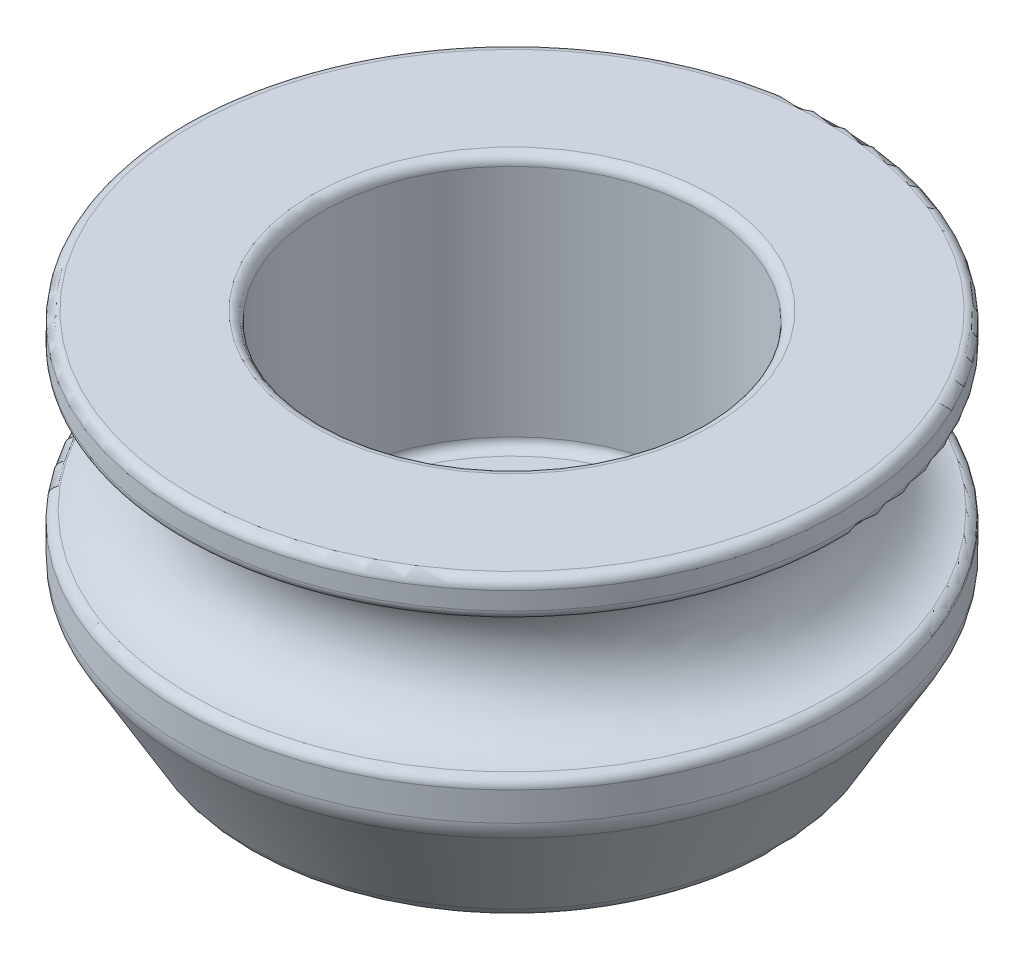
ISO-10303-21;
HEADER;
FILE_DESCRIPTION(('STEP AP214'),'2;1');
FILE_NAME('part.step','',(''),(''),'','','');
FILE_SCHEMA(('AUTOMOTIVE_DESIGN { 1 0 10303 214 1 1 1 1 }'));
ENDSEC;
DATA;
#1=APPLICATION_CONTEXT('core data for automotive mechanical design processes');
#2=APPLICATION_PROTOCOL_DEFINITION('international standard','automotive_design',2000,#1);
#3=PRODUCT_CONTEXT('',#1,'mechanical');
#4=PRODUCT('Part','Part','',(#3));
#5=PRODUCT_RELATED_PRODUCT_CATEGORY('part','',(#4));
#6=PRODUCT_DEFINITION_FORMATION('','',#4);
#7=PRODUCT_DEFINITION_CONTEXT('part definition',#1,'design');
#8=PRODUCT_DEFINITION('design','',#6,#7);
#9=PRODUCT_DEFINITION_SHAPE('','',#8);
#10=(LENGTH_UNIT() NAMED_UNIT(*) SI_UNIT(.MILLI.,.METRE.));
#11=(NAMED_UNIT(*) PLANE_ANGLE_UNIT() SI_UNIT($,.RADIAN.));
#12=(NAMED_UNIT(*) SI_UNIT($,.STERADIAN.) SOLID_ANGLE_UNIT());
#13=UNCERTAINTY_MEASURE_WITH_UNIT(LENGTH_MEASURE(1.E-05),#10,'distance_accuracy_value','');
#14=(GEOMETRIC_REPRESENTATION_CONTEXT(3) GLOBAL_UNCERTAINTY_ASSIGNED_CONTEXT((#13)) GLOBAL_UNIT_ASSIGNED_CONTEXT((#10,
#11,#12)) REPRESENTATION_CONTEXT('',''));
#15=CARTESIAN_POINT('',(0.,0.,0.));
#16=DIRECTION('',(0.,0.,1.));
#17=DIRECTION('',(1.,0.,0.));
#18=AXIS2_PLACEMENT_3D('',#15,#16,#17);
#19=CARTESIAN_POINT('',(0.,9.017,0.));
#20=DIRECTION('',(0.,-1.,0.));
#21=DIRECTION('',(0.,0.,-1.));
#22=AXIS2_PLACEMENT_3D('',#19,#20,#21);
#23=CYLINDRICAL_SURFACE('',#22,8.5725);
#24=CARTESIAN_POINT('',(0.,8.30255699408002,0.));
#25=DIRECTION('',(0.,1.,0.));
#26=DIRECTION('',(0.,0.,1.));
#27=AXIS2_PLACEMENT_3D('',#24,#25,#26);
#28=CIRCLE('',#27,8.5725);
#29=CARTESIAN_POINT('',(0.172203570587984,8.30255699408002,-8.57077022094728));
#30=VERTEX_POINT('',#29);
#31=EDGE_CURVE('E71',#30,#30,#28,.T.);
#32=ORIENTED_EDGE('',*,*,#31,.T.);
#33=EDGE_LOOP('',(#32));
#34=FACE_BOUND('',#33,.T.);
#35=CARTESIAN_POINT('',(0.,8.763,0.));
#36=DIRECTION('',(0.,1.,0.));
#37=DIRECTION('',(0.,0.,1.));
#38=AXIS2_PLACEMENT_3D('',#35,#36,#37);
#39=CIRCLE('',#38,8.5725);
#40=CARTESIAN_POINT('',(0.,8.763,8.5725));
#41=VERTEX_POINT('',#40);
#42=EDGE_CURVE('E110',#41,#41,#39,.F.);
#43=ORIENTED_EDGE('',*,*,#42,.T.);
#44=EDGE_LOOP('',(#43));
#45=FACE_BOUND('',#44,.T.);
#46=ADVANCED_FACE('F41',(#34,#45),#23,.T.);
#47=CARTESIAN_POINT('',(0.,3.52074884677059,0.));
#48=DIRECTION('',(0.,-1.,0.));
#49=DIRECTION('',(0.,0.,-1.));
#50=AXIS2_PLACEMENT_3D('',#47,#48,#49);
#51=CIRCLE('',#50,8.5725);
#52=CARTESIAN_POINT('',(0.,3.52074884677059,-8.5725));
#53=VERTEX_POINT('',#52);
#54=EDGE_CURVE('E82',#53,#53,#51,.F.);
#55=ORIENTED_EDGE('',*,*,#54,.T.);
#56=EDGE_LOOP('',(#55));
#57=FACE_BOUND('',#56,.T.);
#58=CARTESIAN_POINT('',(0.,4.27044300591999,0.));
#59=DIRECTION('',(0.,-1.,0.));
#60=DIRECTION('',(0.,0.,-1.));
#61=AXIS2_PLACEMENT_3D('',#58,#59,#60);
#62=CIRCLE('',#61,8.5725);
#63=CARTESIAN_POINT('',(0.172203570587985,4.27044300591999,-8.57077022094728));
#64=VERTEX_POINT('',#63);
#65=EDGE_CURVE('E104',#64,#64,#62,.T.);
#66=ORIENTED_EDGE('',*,*,#65,.T.);
#67=EDGE_LOOP('',(#66));
#68=FACE_BOUND('',#67,.T.);
#69=ADVANCED_FACE('F98',(#57,#68),#23,.T.);
#70=CARTESIAN_POINT('',(0.,-9.69867661075468,0.));
#71=DIRECTION('',(0.,1.,0.));
#72=DIRECTION('',(0.,0.,1.));
#73=AXIS2_PLACEMENT_3D('',#70,#71,#72);
#74=CYLINDRICAL_SURFACE('',#73,3.429);
#75=CARTESIAN_POINT('',(0.,2.159,0.));
#76=DIRECTION('',(0.,1.,0.));
#77=DIRECTION('',(0.,0.,1.));
#78=AXIS2_PLACEMENT_3D('',#75,#76,#77);
#79=CIRCLE('',#78,3.429);
#80=CARTESIAN_POINT('',(0.,2.159,3.429));
#81=VERTEX_POINT('',#80);
#82=EDGE_CURVE('E125',#81,#81,#79,.T.);
#83=ORIENTED_EDGE('',*,*,#82,.T.);
#84=EDGE_LOOP('',(#83));
#85=FACE_BOUND('',#84,.T.);
#86=CARTESIAN_POINT('',(0.,0.254000000000001,0.));
#87=DIRECTION('',(0.,1.,0.));
#88=DIRECTION('',(0.,0.,1.));
#89=AXIS2_PLACEMENT_3D('',#86,#87,#88);
#90=CIRCLE('',#89,3.429);
#91=CARTESIAN_POINT('',(0.,0.254000000000001,3.429));
#92=VERTEX_POINT('',#91);
#93=EDGE_CURVE('E122',#92,#92,#90,.F.);
#94=ORIENTED_EDGE('',*,*,#93,.T.);
#95=EDGE_LOOP('',(#94));
#96=FACE_BOUND('',#95,.T.);
#97=ADVANCED_FACE('F101',(#85,#96),#74,.F.);
#98=CARTESIAN_POINT('',(0.,9.017,0.));
#99=DIRECTION('',(0.,1.,0.));
#100=DIRECTION('',(0.,0.,1.));
#101=AXIS2_PLACEMENT_3D('',#98,#99,#100);
#102=PLANE('',#101);
#103=CARTESIAN_POINT('',(0.,9.017,0.));
#104=DIRECTION('',(0.,1.,0.));
#105=DIRECTION('',(0.,0.,1.));
#106=AXIS2_PLACEMENT_3D('',#103,#104,#105);
#107=CIRCLE('',#106,5.207);
#108=CARTESIAN_POINT('',(0.,9.017,5.207));
#109=VERTEX_POINT('',#108);
#110=EDGE_CURVE('E79',#109,#109,#107,.F.);
#111=ORIENTED_EDGE('',*,*,#110,.T.);
#112=EDGE_LOOP('',(#111));
#113=FACE_BOUND('',#112,.T.);
#114=CARTESIAN_POINT('',(0.,9.017,0.));
#115=DIRECTION('',(0.,1.,0.));
#116=DIRECTION('',(0.,0.,1.));
#117=AXIS2_PLACEMENT_3D('',#114,#115,#116);
#118=CIRCLE('',#117,8.3185);
#119=CARTESIAN_POINT('',(0.,9.017,8.3185));
#120=VERTEX_POINT('',#119);
#121=EDGE_CURVE('E130',#120,#120,#118,.T.);
#122=ORIENTED_EDGE('',*,*,#121,.T.);
#123=EDGE_LOOP('',(#122));
#124=FACE_BOUND('',#123,.T.);
#125=ADVANCED_FACE('F137',(#113,#124),#102,.T.);
#126=CARTESIAN_POINT('',(0.,0.,0.));
#127=DIRECTION('',(0.,1.,0.));
#128=DIRECTION('',(0.,0.,1.));
#129=AXIS2_PLACEMENT_3D('',#126,#127,#128);
#130=PLANE('',#129);
#131=CARTESIAN_POINT('',(0.,0.,0.));
#132=DIRECTION('',(0.,1.,0.));
#133=DIRECTION('',(0.,0.,1.));
#134=AXIS2_PLACEMENT_3D('',#131,#132,#133);
#135=CIRCLE('',#134,6.19089735278396);
#136=CARTESIAN_POINT('',(0.,0.,6.19089735278396));
#137=VERTEX_POINT('',#136);
#138=EDGE_CURVE('E11',#137,#137,#135,.F.);
#139=ORIENTED_EDGE('',*,*,#138,.T.);
#140=EDGE_LOOP('',(#139));
#141=FACE_BOUND('',#140,.T.);
#142=CARTESIAN_POINT('',(0.,0.,0.));
#143=DIRECTION('',(0.,1.,0.));
#144=DIRECTION('',(0.,0.,1.));
#145=AXIS2_PLACEMENT_3D('',#142,#143,#144);
#146=CIRCLE('',#145,3.683);
#147=CARTESIAN_POINT('',(0.,0.,3.683));
#148=VERTEX_POINT('',#147);
#149=EDGE_CURVE('E128',#148,#148,#146,.T.);
#150=ORIENTED_EDGE('',*,*,#149,.T.);
#151=EDGE_LOOP('',(#150));
#152=FACE_BOUND('',#151,.T.);
#153=ADVANCED_FACE('F159',(#141,#152),#130,.F.);
#154=CARTESIAN_POINT('',(0.,2.413,0.));
#155=DIRECTION('',(0.,1.,0.));
#156=DIRECTION('',(0.,0.,1.));
#157=AXIS2_PLACEMENT_3D('',#154,#155,#156);
#158=PLANE('',#157);
#159=CARTESIAN_POINT('',(0.,2.413,0.));
#160=DIRECTION('',(0.,1.,0.));
#161=DIRECTION('',(0.,0.,1.));
#162=AXIS2_PLACEMENT_3D('',#159,#160,#161);
#163=CIRCLE('',#162,4.699);
#164=CARTESIAN_POINT('',(0.,2.413,4.699));
#165=VERTEX_POINT('',#164);
#166=EDGE_CURVE('E108',#165,#165,#163,.T.);
#167=ORIENTED_EDGE('',*,*,#166,.T.);
#168=EDGE_LOOP('',(#167));
#169=FACE_BOUND('',#168,.T.);
#170=CARTESIAN_POINT('',(0.,2.413,0.));
#171=DIRECTION('',(0.,1.,0.));
#172=DIRECTION('',(0.,0.,1.));
#173=AXIS2_PLACEMENT_3D('',#170,#171,#172);
#174=CIRCLE('',#173,3.683);
#175=CARTESIAN_POINT('',(0.,2.413,3.683));
#176=VERTEX_POINT('',#175);
#177=EDGE_CURVE('E105',#176,#176,#174,.F.);
#178=ORIENTED_EDGE('',*,*,#177,.T.);
#179=EDGE_LOOP('',(#178));
#180=FACE_BOUND('',#179,.T.);
#181=ADVANCED_FACE('F150',(#169,#180),#158,.T.);
#182=CARTESIAN_POINT('',(0.,2.413,0.));
#183=DIRECTION('',(0.,1.,0.));
#184=DIRECTION('',(0.,0.,1.));
#185=AXIS2_PLACEMENT_3D('',#182,#183,#184);
#186=CYLINDRICAL_SURFACE('',#185,4.953);
#187=CARTESIAN_POINT('',(0.,2.667,0.));
#188=DIRECTION('',(0.,1.,0.));
#189=DIRECTION('',(0.,0.,1.));
#190=AXIS2_PLACEMENT_3D('',#187,#188,#189);
#191=CIRCLE('',#190,4.953);
#192=CARTESIAN_POINT('',(0.,2.667,4.953));
#193=VERTEX_POINT('',#192);
#194=EDGE_CURVE('E119',#193,#193,#191,.F.);
#195=CARTESIAN_POINT('',(0.,8.763,0.));
#196=DIRECTION('',(0.,1.,0.));
#197=DIRECTION('',(0.,0.,1.));
#198=AXIS2_PLACEMENT_3D('',#195,#196,#197);
#199=CIRCLE('',#198,4.953);
#200=CARTESIAN_POINT('',(0.,8.763,4.953));
#201=VERTEX_POINT('',#200);
#202=EDGE_CURVE('E116',#201,#201,#199,.T.);
#203=CARTESIAN_POINT('',(0.,2.667,4.953));
#204=CARTESIAN_POINT('',(0.,2.7305,4.953));
#205=CARTESIAN_POINT('',(0.,2.794,4.953));
#206=CARTESIAN_POINT('',(0.,2.921,4.953));
#207=CARTESIAN_POINT('',(0.,2.9845,4.953));
#208=CARTESIAN_POINT('',(0.,3.1115,4.953));
#209=CARTESIAN_POINT('',(0.,3.175,4.953));
#210=CARTESIAN_POINT('',(0.,3.302,4.953));
#211=CARTESIAN_POINT('',(0.,3.3655,4.953));
#212=CARTESIAN_POINT('',(0.,3.4925,4.953));
#213=CARTESIAN_POINT('',(0.,3.556,4.953));
#214=CARTESIAN_POINT('',(0.,3.683,4.953));
#215=CARTESIAN_POINT('',(0.,3.7465,4.953));
#216=CARTESIAN_POINT('',(0.,3.8735,4.953));
#217=CARTESIAN_POINT('',(0.,3.937,4.953));
#218=CARTESIAN_POINT('',(0.,4.064,4.953));
#219=CARTESIAN_POINT('',(0.,4.1275,4.953));
#220=CARTESIAN_POINT('',(0.,4.2545,4.953));
#221=CARTESIAN_POINT('',(0.,4.318,4.953));
#222=CARTESIAN_POINT('',(0.,4.445,4.953));
#223=CARTESIAN_POINT('',(0.,4.5085,4.953));
#224=CARTESIAN_POINT('',(0.,4.6355,4.953));
#225=CARTESIAN_POINT('',(0.,4.699,4.953));
#226=CARTESIAN_POINT('',(0.,4.826,4.953));
#227=CARTESIAN_POINT('',(0.,4.8895,4.953));
#228=CARTESIAN_POINT('',(0.,5.0165,4.953));
#229=CARTESIAN_POINT('',(0.,5.08,4.953));
#230=CARTESIAN_POINT('',(0.,5.207,4.953));
#231=CARTESIAN_POINT('',(0.,5.2705,4.953));
#232=CARTESIAN_POINT('',(0.,5.3975,4.953));
#233=CARTESIAN_POINT('',(0.,5.461,4.953));
#234=CARTESIAN_POINT('',(0.,5.588,4.953));
#235=CARTESIAN_POINT('',(0.,5.6515,4.953));
#236=CARTESIAN_POINT('',(0.,5.7785,4.953));
#237=CARTESIAN_POINT('',(0.,5.842,4.953));
#238=CARTESIAN_POINT('',(0.,5.969,4.953));
#239=CARTESIAN_POINT('',(0.,6.0325,4.953));
#240=CARTESIAN_POINT('',(0.,6.1595,4.953));
#241=CARTESIAN_POINT('',(0.,6.223,4.953));
#242=CARTESIAN_POINT('',(0.,6.35,4.953));
#243=CARTESIAN_POINT('',(0.,6.4135,4.953));
#244=CARTESIAN_POINT('',(0.,6.5405,4.953));
#245=CARTESIAN_POINT('',(0.,6.604,4.953));
#246=CARTESIAN_POINT('',(0.,6.731,4.953));
#247=CARTESIAN_POINT('',(0.,6.7945,4.953));
#248=CARTESIAN_POINT('',(0.,6.9215,4.953));
#249=CARTESIAN_POINT('',(0.,6.985,4.953));
#250=CARTESIAN_POINT('',(0.,7.112,4.953));
#251=CARTESIAN_POINT('',(0.,7.1755,4.953));
#252=CARTESIAN_POINT('',(0.,7.3025,4.953));
#253=CARTESIAN_POINT('',(0.,7.366,4.953));
#254=CARTESIAN_POINT('',(0.,7.493,4.953));
#255=CARTESIAN_POINT('',(0.,7.5565,4.953));
#256=CARTESIAN_POINT('',(0.,7.6835,4.953));
#257=CARTESIAN_POINT('',(0.,7.747,4.953));
#258=CARTESIAN_POINT('',(0.,7.874,4.953));
#259=CARTESIAN_POINT('',(0.,7.9375,4.953));
#260=CARTESIAN_POINT('',(0.,8.0645,4.953));
#261=CARTESIAN_POINT('',(0.,8.128,4.953));
#262=CARTESIAN_POINT('',(0.,8.255,4.953));
#263=CARTESIAN_POINT('',(0.,8.3185,4.953));
#264=CARTESIAN_POINT('',(0.,8.4455,4.953));
#265=CARTESIAN_POINT('',(0.,8.509,4.953));
#266=CARTESIAN_POINT('',(0.,8.636,4.953));
#267=CARTESIAN_POINT('',(0.,8.6995,4.953));
#268=CARTESIAN_POINT('',(0.,8.763,4.953));
#269=B_SPLINE_CURVE_WITH_KNOTS('',3,(#203,#204,#205,#206,#207,#208,#209,#210,#211,#212,#213,
#214,#215,#216,#217,#218,#219,#220,#221,#222,#223,#224,#225,#226,#227,#228,#229,#230,#231,#232,
#233,#234,#235,#236,#237,#238,#239,#240,#241,#242,#243,#244,#245,#246,#247,#248,#249,#250,#251,
#252,#253,#254,#255,#256,#257,#258,#259,#260,#261,#262,#263,#264,#265,#266,#267,#268),
.UNSPECIFIED.,.F.,.F.,(4,2,2,2,2,2,2,2,2,2,2,2,2,2,2,2,2,2,2,2,2,2,2,2,2,2,2,2,2,2,2,2,4),(0.,
0.1905,0.381,0.5715,0.762,0.9525,1.143,1.3335,1.524,1.7145,1.905,2.0955,2.286,2.4765,2.667,
2.8575,3.048,3.2385,3.429,3.6195,3.81,4.0005,4.191,4.3815,4.572,4.7625,4.953,5.1435,5.334,
5.5245,5.715,5.9055,6.096),.UNSPECIFIED.);
#270=EDGE_CURVE('BSEAM147',#193,#201,#269,.T.);
#271=ORIENTED_EDGE('',*,*,#194,.T.);
#272=ORIENTED_EDGE('',*,*,#202,.T.);
#273=ORIENTED_EDGE('',*,*,#270,.T.);
#274=ORIENTED_EDGE('',*,*,#270,.F.);
#275=EDGE_LOOP('',(#271,#273,#272,#274));
#276=FACE_BOUND('',#275,.T.);
#277=ADVANCED_FACE('F147',(#276),#186,.F.);
#278=CARTESIAN_POINT('',(0.167739254163598,6.2865,-10.3488587546764));
#279=CARTESIAN_POINT('',(-20.5299782551891,6.2865,-10.6843372630036));
#280=CARTESIAN_POINT('',(-20.8654567635163,6.2865,10.0133802463492));
#281=CARTESIAN_POINT('',(-0.167739254163598,6.2865,10.3488587546764));
#282=CARTESIAN_POINT('',(20.5299782551891,6.2865,10.6843372630036));
#283=CARTESIAN_POINT('',(20.8654567635163,6.2865,-10.0133802463492));
#284=CARTESIAN_POINT('',(0.167739254163598,6.2865,-10.3488587546764));
#285=CARTESIAN_POINT('',(0.167739254163598,9.8425,-10.3488587546764));
#286=CARTESIAN_POINT('',(-20.5299782551891,9.8425,-10.6843372630036));
#287=CARTESIAN_POINT('',(-20.8654567635163,9.8425,10.0133802463492));
#288=CARTESIAN_POINT('',(-0.167739254163598,9.8425,10.3488587546764));
#289=CARTESIAN_POINT('',(20.5299782551891,9.8425,10.6843372630036));
#290=CARTESIAN_POINT('',(20.8654567635163,9.8425,-10.0133802463492));
#291=CARTESIAN_POINT('',(0.167739254163598,9.8425,-10.3488587546764));
#292=CARTESIAN_POINT('',(0.167739254163598,9.8425,-6.79285875467638));
#293=CARTESIAN_POINT('',(-13.4179782551892,9.8425,-7.12833726300357));
#294=CARTESIAN_POINT('',(-13.7534567635164,9.8425,6.45738024634918));
#295=CARTESIAN_POINT('',(-0.167739254163598,9.8425,6.79285875467638));
#296=CARTESIAN_POINT('',(13.4179782551892,9.8425,7.12833726300357));
#297=CARTESIAN_POINT('',(13.7534567635164,9.8425,-6.45738024634918));
#298=CARTESIAN_POINT('',(0.167739254163598,9.8425,-6.79285875467638));
#299=CARTESIAN_POINT('',(0.167739254163598,6.2865,-6.79285875467638));
#300=CARTESIAN_POINT('',(-13.4179782551892,6.2865,-7.12833726300357));
#301=CARTESIAN_POINT('',(-13.7534567635164,6.2865,6.45738024634918));
#302=CARTESIAN_POINT('',(-0.167739254163598,6.2865,6.79285875467638));
#303=CARTESIAN_POINT('',(13.4179782551892,6.2865,7.12833726300357));
#304=CARTESIAN_POINT('',(13.7534567635164,6.2865,-6.45738024634918));
#305=CARTESIAN_POINT('',(0.167739254163598,6.2865,-6.79285875467638));
#306=CARTESIAN_POINT('',(0.167739254163598,2.73050000000001,-6.79285875467637));
#307=CARTESIAN_POINT('',(-13.4179782551892,2.7305,-7.12833726300357));
#308=CARTESIAN_POINT('',(-13.7534567635163,2.7305,6.45738024634918));
#309=CARTESIAN_POINT('',(-0.167739254163598,2.73050000000001,6.79285875467637));
#310=CARTESIAN_POINT('',(13.4179782551892,2.7305,7.12833726300357));
#311=CARTESIAN_POINT('',(13.7534567635163,2.7305,-6.45738024634918));
#312=CARTESIAN_POINT('',(0.167739254163598,2.73050000000001,-6.79285875467637));
#313=CARTESIAN_POINT('',(0.167739254163598,2.73050000000001,-10.3488587546764));
#314=CARTESIAN_POINT('',(-20.5299782551891,2.7305,-10.6843372630036));
#315=CARTESIAN_POINT('',(-20.8654567635163,2.7305,10.0133802463492));
#316=CARTESIAN_POINT('',(-0.167739254163598,2.73050000000001,10.3488587546764));
#317=CARTESIAN_POINT('',(20.5299782551891,2.7305,10.6843372630036));
#318=CARTESIAN_POINT('',(20.8654567635163,2.7305,-10.0133802463492));
#319=CARTESIAN_POINT('',(0.167739254163598,2.73050000000001,-10.3488587546764));
#320=CARTESIAN_POINT('',(0.167739254163598,6.2865,-10.3488587546764));
#321=CARTESIAN_POINT('',(-20.5299782551891,6.2865,-10.6843372630036));
#322=CARTESIAN_POINT('',(-20.8654567635163,6.2865,10.0133802463492));
#323=CARTESIAN_POINT('',(-0.167739254163598,6.2865,10.3488587546764));
#324=CARTESIAN_POINT('',(20.5299782551891,6.2865,10.6843372630036));
#325=CARTESIAN_POINT('',(20.8654567635163,6.2865,-10.0133802463492));
#326=CARTESIAN_POINT('',(0.167739254163598,6.2865,-10.3488587546764));
#327=(BOUNDED_SURFACE() B_SPLINE_SURFACE(3,3,((#278,#279,#280,#281,#282,#283,#284),(#285,#286,
#287,#288,#289,#290,#291),(#292,#293,#294,#295,#296,#297,#298),(#299,#300,#301,#302,#303,#304,
#305),(#306,#307,#308,#309,#310,#311,#312),(#313,#314,#315,#316,#317,#318,#319),(#320,#321,#322,
#323,#324,#325,#326)),.UNSPECIFIED.,.T.,.T.,.F.) B_SPLINE_SURFACE_WITH_KNOTS((4,3,4),(4,3,4),
(0.,0.5,1.),(0.,0.5,1.),
.UNSPECIFIED.) GEOMETRIC_REPRESENTATION_ITEM() RATIONAL_B_SPLINE_SURFACE(((1.,0.333333333333333,
0.333333333333333,1.,0.333333333333333,0.333333333333333,1.),(0.333333333333333,
0.111111111111111,0.111111111111111,0.333333333333333,0.111111111111111,0.111111111111111,
0.333333333333333),(0.333333333333333,0.111111111111111,0.111111111111111,0.333333333333333,
0.111111111111111,0.111111111111111,0.333333333333333),(1.,0.333333333333333,0.333333333333333,
1.,0.333333333333333,0.333333333333333,1.),(0.333333333333333,0.111111111111111,
0.111111111111111,0.333333333333333,0.111111111111111,0.111111111111111,0.333333333333333),
(0.333333333333333,0.111111111111111,0.111111111111111,0.333333333333333,0.111111111111111,
0.111111111111111,0.333333333333333),(1.,0.333333333333333,0.333333333333333,1.,
0.333333333333333,0.333333333333333,1.))) REPRESENTATION_ITEM('') SURFACE());
#328=CARTESIAN_POINT('',(0.167739254163598,6.2865,-8.57085875467637));
#329=DIRECTION('',(1.,0.,0.));
#330=DIRECTION('',(0.,0.,-1.));
#331=AXIS2_PLACEMENT_3D('',#328,#329,#330);
#332=CIRCLE('',#331,1.778);
#333=CARTESIAN_POINT('',(0.167739254163598,8.05055056545504,-8.34857604613213));
#334=VERTEX_POINT('',#333);
#335=CARTESIAN_POINT('',(0.167739254163598,4.52244943454497,-8.34857604613212));
#336=VERTEX_POINT('',#335);
#337=EDGE_CURVE('E72',#334,#336,#332,.T.);
#338=CARTESIAN_POINT('',(0.,8.05055056545504,0.));
#339=DIRECTION('',(0.,1.,0.));
#340=DIRECTION('',(0.,0.,1.));
#341=AXIS2_PLACEMENT_3D('',#338,#339,#340);
#342=CIRCLE('',#341,8.35026098127709);
#343=EDGE_CURVE('E69',#334,#334,#342,.F.);
#344=CARTESIAN_POINT('',(0.,4.52244943454497,0.));
#345=DIRECTION('',(0.,1.,0.));
#346=DIRECTION('',(0.,0.,1.));
#347=AXIS2_PLACEMENT_3D('',#344,#345,#346);
#348=CIRCLE('',#347,8.35026098127708);
#349=EDGE_CURVE('E75',#336,#336,#348,.T.);
#350=ORIENTED_EDGE('',*,*,#337,.F.);
#351=ORIENTED_EDGE('',*,*,#343,.T.);
#352=ORIENTED_EDGE('',*,*,#337,.T.);
#353=ORIENTED_EDGE('',*,*,#349,.T.);
#354=EDGE_LOOP('',(#350,#351,#352,#353));
#355=FACE_BOUND('',#354,.T.);
#356=ADVANCED_FACE('F149',(#355),#327,.T.);
#357=CARTESIAN_POINT('',(0.,8.30255699408002,0.));
#358=DIRECTION('',(0.,1.,0.));
#359=DIRECTION('',(0.,0.,1.));
#360=AXIS2_PLACEMENT_3D('',#357,#358,#359);
#361=TOROIDAL_SURFACE('',#360,8.3185,0.254);
#362=CARTESIAN_POINT('',(0.167101242570563,8.30255699408002,-8.31682147365996));
#363=DIRECTION('',(-0.999798217666641,0.,-0.0200879055804007));
#364=DIRECTION('',(-0.0200879055804007,0.,0.999798217666641));
#365=AXIS2_PLACEMENT_3D('',#362,#363,#364);
#366=CIRCLE('',#365,0.254);
#367=EDGE_CURVE('E63',#30,#334,#366,.T.);
#368=ORIENTED_EDGE('',*,*,#367,.F.);
#369=ORIENTED_EDGE('',*,*,#31,.F.);
#370=ORIENTED_EDGE('',*,*,#367,.T.);
#371=ORIENTED_EDGE('',*,*,#343,.F.);
#372=EDGE_LOOP('',(#368,#369,#370,#371));
#373=FACE_BOUND('',#372,.T.);
#374=ADVANCED_FACE('F67',(#373),#361,.T.);
#375=CARTESIAN_POINT('',(0.,4.27044300591999,0.));
#376=DIRECTION('',(0.,-1.,0.));
#377=DIRECTION('',(0.,0.,-1.));
#378=AXIS2_PLACEMENT_3D('',#375,#376,#377);
#379=TOROIDAL_SURFACE('',#378,8.3185,0.254);
#380=CARTESIAN_POINT('',(0.167101242570563,4.27044300591999,-8.31682147365996));
#381=DIRECTION('',(0.999798217666641,0.,0.0200879055804007));
#382=DIRECTION('',(0.0200879055804007,0.,-0.999798217666641));
#383=AXIS2_PLACEMENT_3D('',#380,#381,#382);
#384=CIRCLE('',#383,0.254);
#385=EDGE_CURVE('E56',#64,#336,#384,.T.);
#386=ORIENTED_EDGE('',*,*,#385,.F.);
#387=ORIENTED_EDGE('',*,*,#65,.F.);
#388=ORIENTED_EDGE('',*,*,#385,.T.);
#389=ORIENTED_EDGE('',*,*,#349,.F.);
#390=EDGE_LOOP('',(#386,#387,#388,#389));
#391=FACE_BOUND('',#390,.T.);
#392=ADVANCED_FACE('F173',(#391),#379,.T.);
#393=CARTESIAN_POINT('',(0.,2.667,0.));
#394=DIRECTION('',(0.,1.,0.));
#395=DIRECTION('',(0.,0.,1.));
#396=AXIS2_PLACEMENT_3D('',#393,#394,#395);
#397=TOROIDAL_SURFACE('',#396,4.699,0.254);
#398=ORIENTED_EDGE('',*,*,#194,.F.);
#399=EDGE_LOOP('',(#398));
#400=FACE_BOUND('',#399,.T.);
#401=ORIENTED_EDGE('',*,*,#166,.F.);
#402=EDGE_LOOP('',(#401));
#403=FACE_BOUND('',#402,.T.);
#404=ADVANCED_FACE('F176',(#400,#403),#397,.F.);
#405=CARTESIAN_POINT('',(0.,2.159,0.));
#406=DIRECTION('',(0.,1.,0.));
#407=DIRECTION('',(0.,0.,1.));
#408=AXIS2_PLACEMENT_3D('',#405,#406,#407);
#409=TOROIDAL_SURFACE('',#408,3.683,0.254);
#410=ORIENTED_EDGE('',*,*,#82,.F.);
#411=EDGE_LOOP('',(#410));
#412=FACE_BOUND('',#411,.T.);
#413=ORIENTED_EDGE('',*,*,#177,.F.);
#414=EDGE_LOOP('',(#413));
#415=FACE_BOUND('',#414,.T.);
#416=ADVANCED_FACE('F179',(#412,#415),#409,.T.);
#417=CARTESIAN_POINT('',(0.,0.254000000000001,0.));
#418=DIRECTION('',(0.,1.,0.));
#419=DIRECTION('',(0.,0.,1.));
#420=AXIS2_PLACEMENT_3D('',#417,#418,#419);
#421=TOROIDAL_SURFACE('',#420,3.683,0.254);
#422=ORIENTED_EDGE('',*,*,#149,.F.);
#423=EDGE_LOOP('',(#422));
#424=FACE_BOUND('',#423,.T.);
#425=ORIENTED_EDGE('',*,*,#93,.F.);
#426=EDGE_LOOP('',(#425));
#427=FACE_BOUND('',#426,.T.);
#428=ADVANCED_FACE('F143',(#424,#427),#421,.T.);
#429=CARTESIAN_POINT('',(0.,8.763,0.));
#430=DIRECTION('',(0.,1.,0.));
#431=DIRECTION('',(0.,0.,1.));
#432=AXIS2_PLACEMENT_3D('',#429,#430,#431);
#433=TOROIDAL_SURFACE('',#432,5.207,0.254);
#434=ORIENTED_EDGE('',*,*,#110,.F.);
#435=EDGE_LOOP('',(#434));
#436=FACE_BOUND('',#435,.T.);
#437=ORIENTED_EDGE('',*,*,#202,.F.);
#438=EDGE_LOOP('',(#437));
#439=FACE_BOUND('',#438,.T.);
#440=ADVANCED_FACE('F139',(#436,#439),#433,.T.);
#441=CARTESIAN_POINT('',(0.,8.763,0.));
#442=DIRECTION('',(0.,1.,0.));
#443=DIRECTION('',(0.,0.,1.));
#444=AXIS2_PLACEMENT_3D('',#441,#442,#443);
#445=TOROIDAL_SURFACE('',#444,8.3185,0.254);
#446=ORIENTED_EDGE('',*,*,#42,.F.);
#447=EDGE_LOOP('',(#446));
#448=FACE_BOUND('',#447,.T.);
#449=ORIENTED_EDGE('',*,*,#121,.F.);
#450=EDGE_LOOP('',(#449));
#451=FACE_BOUND('',#450,.T.);
#452=ADVANCED_FACE('F142',(#448,#451),#445,.T.);
#453=CARTESIAN_POINT('',(0.,3.2995567884187,0.));
#454=DIRECTION('',(0.,1.,0.));
#455=DIRECTION('',(0.,0.,1.));
#456=AXIS2_PLACEMENT_3D('',#453,#454,#455);
#457=CONICAL_SURFACE('',#456,8.5725,0.5235987755983);
#458=CARTESIAN_POINT('',(0.,3.10799884677059,0.));
#459=DIRECTION('',(0.,1.,0.));
#460=DIRECTION('',(0.,0.,1.));
#461=AXIS2_PLACEMENT_3D('',#458,#459,#460);
#462=CIRCLE('',#461,8.46190397082406);
#463=CARTESIAN_POINT('',(0.,3.10799884677059,8.46190397082406));
#464=VERTEX_POINT('',#463);
#465=EDGE_CURVE('E49',#464,#464,#462,.F.);
#466=ORIENTED_EDGE('',*,*,#465,.T.);
#467=EDGE_LOOP('',(#466));
#468=FACE_BOUND('',#467,.T.);
#469=CARTESIAN_POINT('',(0.,0.412749999999999,0.));
#470=DIRECTION('',(0.,1.,0.));
#471=DIRECTION('',(0.,0.,1.));
#472=AXIS2_PLACEMENT_3D('',#469,#470,#471);
#473=CIRCLE('',#472,6.90580132360802);
#474=CARTESIAN_POINT('',(0.,0.412749999999999,6.90580132360802));
#475=VERTEX_POINT('',#474);
#476=EDGE_CURVE('E85',#475,#475,#473,.T.);
#477=ORIENTED_EDGE('',*,*,#476,.T.);
#478=EDGE_LOOP('',(#477));
#479=FACE_BOUND('',#478,.T.);
#480=ADVANCED_FACE('F90',(#468,#479),#457,.T.);
#481=CARTESIAN_POINT('',(0.,3.52074884677059,0.));
#482=DIRECTION('',(0.,-1.,0.));
#483=DIRECTION('',(0.,0.,-1.));
#484=AXIS2_PLACEMENT_3D('',#481,#482,#483);
#485=TOROIDAL_SURFACE('',#484,7.747,0.8255);
#486=ORIENTED_EDGE('',*,*,#465,.F.);
#487=EDGE_LOOP('',(#486));
#488=FACE_BOUND('',#487,.T.);
#489=ORIENTED_EDGE('',*,*,#54,.F.);
#490=EDGE_LOOP('',(#489));
#491=FACE_BOUND('',#490,.T.);
#492=ADVANCED_FACE('F93',(#488,#491),#485,.T.);
#493=CARTESIAN_POINT('',(0.,0.8255,0.));
#494=DIRECTION('',(0.,1.,0.));
#495=DIRECTION('',(0.,0.,1.));
#496=AXIS2_PLACEMENT_3D('',#493,#494,#495);
#497=TOROIDAL_SURFACE('',#496,6.19089735278396,0.8255);
#498=ORIENTED_EDGE('',*,*,#476,.F.);
#499=EDGE_LOOP('',(#498));
#500=FACE_BOUND('',#499,.T.);
#501=ORIENTED_EDGE('',*,*,#138,.F.);
#502=EDGE_LOOP('',(#501));
#503=FACE_BOUND('',#502,.T.);
#504=ADVANCED_FACE('F43',(#500,#503),#497,.T.);
#505=CLOSED_SHELL('',(#46,#69,#97,#125,#153,#181,#277,#356,#374,#392,#404,#416,#428,#440,#452,
#480,#492,#504));
#506=MANIFOLD_SOLID_BREP('B2',#505);
#507=ADVANCED_BREP_SHAPE_REPRESENTATION('',(#18,#506),#14);
#508=SHAPE_DEFINITION_REPRESENTATION(#9,#507);
ENDSEC;
END-ISO-10303-21;
